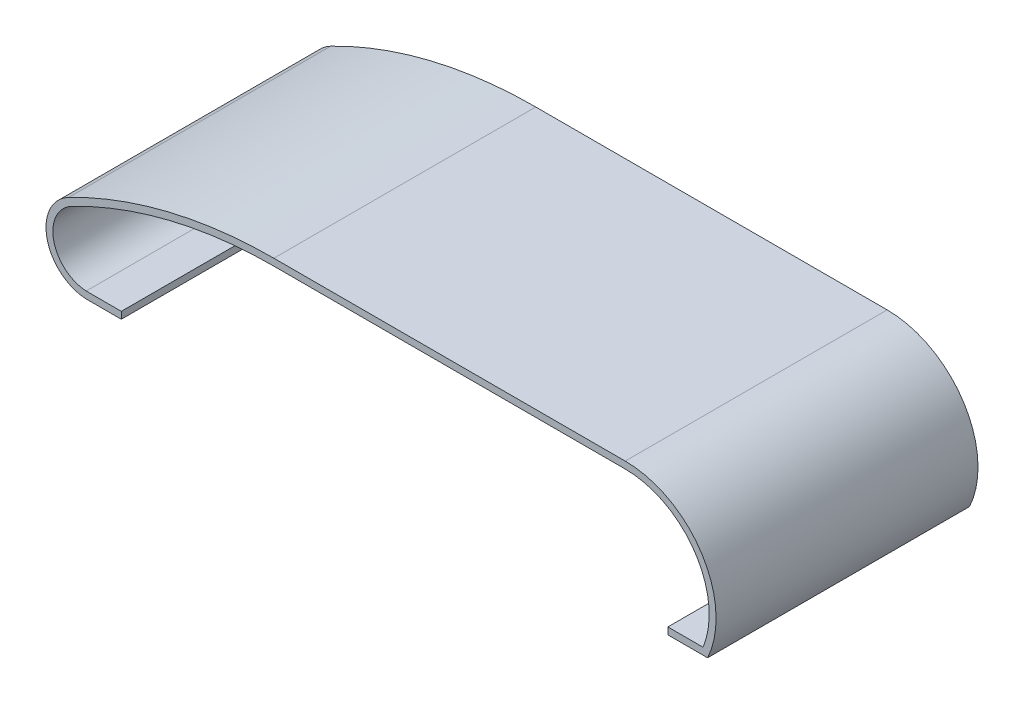
ISO-10303-21;
HEADER;
FILE_DESCRIPTION(('STEP AP214'),'2;1');
FILE_NAME('part.step','',(''),(''),'','','');
FILE_SCHEMA(('AUTOMOTIVE_DESIGN { 1 0 10303 214 1 1 1 1 }'));
ENDSEC;
DATA;
#1=APPLICATION_CONTEXT('core data for automotive mechanical design processes');
#2=APPLICATION_PROTOCOL_DEFINITION('international standard','automotive_design',2000,#1);
#3=PRODUCT_CONTEXT('',#1,'mechanical');
#4=PRODUCT('Part','Part','',(#3));
#5=PRODUCT_RELATED_PRODUCT_CATEGORY('part','',(#4));
#6=PRODUCT_DEFINITION_FORMATION('','',#4);
#7=PRODUCT_DEFINITION_CONTEXT('part definition',#1,'design');
#8=PRODUCT_DEFINITION('design','',#6,#7);
#9=PRODUCT_DEFINITION_SHAPE('','',#8);
#10=(LENGTH_UNIT() NAMED_UNIT(*) SI_UNIT(.MILLI.,.METRE.));
#11=(NAMED_UNIT(*) PLANE_ANGLE_UNIT() SI_UNIT($,.RADIAN.));
#12=(NAMED_UNIT(*) SI_UNIT($,.STERADIAN.) SOLID_ANGLE_UNIT());
#13=UNCERTAINTY_MEASURE_WITH_UNIT(LENGTH_MEASURE(1.E-05),#10,'distance_accuracy_value','');
#14=(GEOMETRIC_REPRESENTATION_CONTEXT(3) GLOBAL_UNCERTAINTY_ASSIGNED_CONTEXT((#13)) GLOBAL_UNIT_ASSIGNED_CONTEXT((#10,
#11,#12)) REPRESENTATION_CONTEXT('',''));
#15=CARTESIAN_POINT('',(0.,0.,0.));
#16=DIRECTION('',(0.,0.,1.));
#17=DIRECTION('',(1.,0.,0.));
#18=AXIS2_PLACEMENT_3D('',#15,#16,#17);
#19=CARTESIAN_POINT('',(0.,14.5,38.));
#20=DIRECTION('',(0.,-1.,0.));
#21=DIRECTION('',(1.,0.,0.));
#22=AXIS2_PLACEMENT_3D('',#19,#20,#21);
#23=PLANE('',#22);
#24=DIRECTION('',(-1.,0.,0.));
#25=VECTOR('',#24,1.);
#26=CARTESIAN_POINT('',(0.,14.5,0.));
#27=LINE('',#26,#25);
#28=CARTESIAN_POINT('',(66.5200000000003,14.5,0.));
#29=VERTEX_POINT('',#28);
#30=CARTESIAN_POINT('',(15.5400000000003,14.5,0.));
#31=VERTEX_POINT('',#30);
#32=EDGE_CURVE('E170',#29,#31,#27,.T.);
#33=ORIENTED_EDGE('',*,*,#32,.T.);
#34=DIRECTION('',(0.,0.,-1.));
#35=VECTOR('',#34,1.);
#36=CARTESIAN_POINT('',(15.5400000000003,14.5,38.));
#37=LINE('',#36,#35);
#38=CARTESIAN_POINT('',(15.5400000000003,14.5,38.));
#39=VERTEX_POINT('',#38);
#40=EDGE_CURVE('E11',#39,#31,#37,.T.);
#41=ORIENTED_EDGE('',*,*,#40,.F.);
#42=DIRECTION('',(-1.,0.,0.));
#43=VECTOR('',#42,1.);
#44=CARTESIAN_POINT('',(0.,14.5,38.));
#45=LINE('',#44,#43);
#46=CARTESIAN_POINT('',(66.5200000000003,14.5,38.));
#47=VERTEX_POINT('',#46);
#48=EDGE_CURVE('E205',#47,#39,#45,.T.);
#49=ORIENTED_EDGE('',*,*,#48,.F.);
#50=DIRECTION('',(0.,0.,-1.));
#51=VECTOR('',#50,1.);
#52=CARTESIAN_POINT('',(66.5200000000003,14.5,38.));
#53=LINE('',#52,#51);
#54=EDGE_CURVE('E53',#47,#29,#53,.T.);
#55=ORIENTED_EDGE('',*,*,#54,.T.);
#56=EDGE_LOOP('',(#33,#41,#49,#55));
#57=FACE_BOUND('',#56,.T.);
#58=ADVANCED_FACE('F37',(#57),#23,.F.);
#59=CARTESIAN_POINT('',(15.5400000000003,-50.2795958789134,38.));
#60=DIRECTION('',(0.,0.,-1.));
#61=DIRECTION('',(-1.,0.,0.));
#62=AXIS2_PLACEMENT_3D('',#59,#60,#61);
#63=CYLINDRICAL_SURFACE('',#62,64.7795958789135);
#64=CARTESIAN_POINT('',(15.5400000000003,-50.2795958789134,0.));
#65=DIRECTION('',(0.,0.,1.));
#66=DIRECTION('',(1.,0.,0.));
#67=AXIS2_PLACEMENT_3D('',#64,#65,#66);
#68=CIRCLE('',#67,64.7795958789135);
#69=CARTESIAN_POINT('',(-14.2250375276555,7.25681505549044,0.));
#70=VERTEX_POINT('',#69);
#71=EDGE_CURVE('E172',#31,#70,#68,.T.);
#72=ORIENTED_EDGE('',*,*,#71,.T.);
#73=DIRECTION('',(0.,0.,-1.));
#74=VECTOR('',#73,1.);
#75=CARTESIAN_POINT('',(-14.2250375276555,7.25681505549044,38.));
#76=LINE('',#75,#74);
#77=CARTESIAN_POINT('',(-14.2250375276555,7.25681505549044,38.));
#78=VERTEX_POINT('',#77);
#79=EDGE_CURVE('E45',#78,#70,#76,.T.);
#80=ORIENTED_EDGE('',*,*,#79,.F.);
#81=CARTESIAN_POINT('',(15.5400000000003,-50.2795958789134,38.));
#82=DIRECTION('',(0.,0.,1.));
#83=DIRECTION('',(1.,0.,0.));
#84=AXIS2_PLACEMENT_3D('',#81,#82,#83);
#85=CIRCLE('',#84,64.7795958789135);
#86=EDGE_CURVE('E109',#39,#78,#85,.T.);
#87=ORIENTED_EDGE('',*,*,#86,.F.);
#88=ORIENTED_EDGE('',*,*,#40,.T.);
#89=EDGE_LOOP('',(#72,#80,#87,#88));
#90=FACE_BOUND('',#89,.T.);
#91=ADVANCED_FACE('F283',(#90),#63,.T.);
#92=CARTESIAN_POINT('',(-11.426599769246,1.84737907905001,38.));
#93=DIRECTION('',(0.,0.,-1.));
#94=DIRECTION('',(-1.,0.,0.));
#95=AXIS2_PLACEMENT_3D('',#92,#93,#94);
#96=CYLINDRICAL_SURFACE('',#95,6.09042293038011);
#97=CARTESIAN_POINT('',(-11.426599769246,1.84737907905001,0.));
#98=DIRECTION('',(0.,0.,1.));
#99=DIRECTION('',(1.,0.,0.));
#100=AXIS2_PLACEMENT_3D('',#97,#98,#99);
#101=CIRCLE('',#100,6.09042293038011);
#102=CARTESIAN_POINT('',(-11.7115140980292,-4.23637595350628,0.));
#103=VERTEX_POINT('',#102);
#104=EDGE_CURVE('E174',#70,#103,#101,.T.);
#105=ORIENTED_EDGE('',*,*,#104,.T.);
#106=DIRECTION('',(0.,0.,-1.));
#107=VECTOR('',#106,1.);
#108=CARTESIAN_POINT('',(-11.7115140980292,-4.23637595350628,38.));
#109=LINE('',#108,#107);
#110=CARTESIAN_POINT('',(-11.7115140980292,-4.23637595350628,38.));
#111=VERTEX_POINT('',#110);
#112=EDGE_CURVE('E224',#111,#103,#109,.T.);
#113=ORIENTED_EDGE('',*,*,#112,.F.);
#114=CARTESIAN_POINT('',(-11.426599769246,1.84737907905001,38.));
#115=DIRECTION('',(0.,0.,1.));
#116=DIRECTION('',(1.,0.,0.));
#117=AXIS2_PLACEMENT_3D('',#114,#115,#116);
#118=CIRCLE('',#117,6.09042293038011);
#119=EDGE_CURVE('E231',#78,#111,#118,.T.);
#120=ORIENTED_EDGE('',*,*,#119,.F.);
#121=ORIENTED_EDGE('',*,*,#79,.T.);
#122=EDGE_LOOP('',(#105,#113,#120,#121));
#123=FACE_BOUND('',#122,.T.);
#124=ADVANCED_FACE('F229',(#123),#96,.T.);
#125=CARTESIAN_POINT('',(-0.000322696639036166,-4.23726784003482,38.));
#126=DIRECTION('',(-7.61567713637186E-05,-0.999999997100073,0.));
#127=DIRECTION('',(0.999999997100073,-7.61567713637186E-05,0.));
#128=AXIS2_PLACEMENT_3D('',#125,#126,#127);
#129=PLANE('',#128);
#130=DIRECTION('',(-0.999999997100073,7.61567713637186E-05,0.));
#131=VECTOR('',#130,1.);
#132=CARTESIAN_POINT('',(-0.000322696639036166,-4.23726784003482,0.));
#133=LINE('',#132,#131);
#134=CARTESIAN_POINT('',(-6.59040304305799,-4.23676596079115,0.));
#135=VERTEX_POINT('',#134);
#136=EDGE_CURVE('E177',#135,#103,#133,.T.);
#137=ORIENTED_EDGE('',*,*,#136,.F.);
#138=DIRECTION('',(0.,0.,-1.));
#139=VECTOR('',#138,1.);
#140=CARTESIAN_POINT('',(-6.59040304305799,-4.23676596079115,38.));
#141=LINE('',#140,#139);
#142=CARTESIAN_POINT('',(-6.59040304305799,-4.23676596079115,38.));
#143=VERTEX_POINT('',#142);
#144=EDGE_CURVE('E222',#143,#135,#141,.T.);
#145=ORIENTED_EDGE('',*,*,#144,.F.);
#146=DIRECTION('',(-0.999999997100073,7.61567713637186E-05,0.));
#147=VECTOR('',#146,1.);
#148=CARTESIAN_POINT('',(-0.000322696639036166,-4.23726784003482,38.));
#149=LINE('',#148,#147);
#150=EDGE_CURVE('E240',#143,#111,#149,.T.);
#151=ORIENTED_EDGE('',*,*,#150,.T.);
#152=ORIENTED_EDGE('',*,*,#112,.T.);
#153=EDGE_LOOP('',(#137,#145,#151,#152));
#154=FACE_BOUND('',#153,.T.);
#155=ADVANCED_FACE('F237',(#154),#129,.T.);
#156=CARTESIAN_POINT('',(-6.59008034641899,0.000501879243616689,38.));
#157=DIRECTION('',(0.999999997100073,-7.61567713562088E-05,0.));
#158=DIRECTION('',(7.61567713562088E-05,0.999999997100073,0.));
#159=AXIS2_PLACEMENT_3D('',#156,#157,#158);
#160=PLANE('',#159);
#161=DIRECTION('',(-7.61567713562088E-05,-0.999999997100073,0.));
#162=VECTOR('',#161,1.);
#163=CARTESIAN_POINT('',(-6.59008034641899,0.000501879243616689,0.));
#164=LINE('',#163,#162);
#165=CARTESIAN_POINT('',(-6.59032688628663,-3.23676596369108,0.));
#166=VERTEX_POINT('',#165);
#167=EDGE_CURVE('E180',#166,#135,#164,.T.);
#168=ORIENTED_EDGE('',*,*,#167,.F.);
#169=DIRECTION('',(0.,0.,-1.));
#170=VECTOR('',#169,1.);
#171=CARTESIAN_POINT('',(-6.59032688628663,-3.23676596369108,38.));
#172=LINE('',#171,#170);
#173=CARTESIAN_POINT('',(-6.59032688628663,-3.23676596369108,38.));
#174=VERTEX_POINT('',#173);
#175=EDGE_CURVE('E220',#174,#166,#172,.T.);
#176=ORIENTED_EDGE('',*,*,#175,.F.);
#177=DIRECTION('',(-7.61567713562088E-05,-0.999999997100073,0.));
#178=VECTOR('',#177,1.);
#179=CARTESIAN_POINT('',(-6.59008034641899,0.000501879243616689,38.));
#180=LINE('',#179,#178);
#181=EDGE_CURVE('E243',#174,#143,#180,.T.);
#182=ORIENTED_EDGE('',*,*,#181,.T.);
#183=ORIENTED_EDGE('',*,*,#144,.T.);
#184=EDGE_LOOP('',(#168,#176,#182,#183));
#185=FACE_BOUND('',#184,.T.);
#186=ADVANCED_FACE('F296',(#185),#160,.T.);
#187=CARTESIAN_POINT('',(-0.000246539867671432,-3.23726784293474,38.));
#188=DIRECTION('',(7.61567713634051E-05,0.999999997100073,0.));
#189=DIRECTION('',(-0.999999997100073,7.61567713634051E-05,0.));
#190=AXIS2_PLACEMENT_3D('',#187,#188,#189);
#191=PLANE('',#190);
#192=DIRECTION('',(0.999999997100073,-7.61567713634051E-05,0.));
#193=VECTOR('',#192,1.);
#194=CARTESIAN_POINT('',(-0.000246539867671432,-3.23726784293474,0.));
#195=LINE('',#194,#193);
#196=CARTESIAN_POINT('',(-11.6870252792904,-3.23637781559573,0.));
#197=VERTEX_POINT('',#196);
#198=EDGE_CURVE('E183',#197,#166,#195,.T.);
#199=ORIENTED_EDGE('',*,*,#198,.F.);
#200=DIRECTION('',(0.,0.,-1.));
#201=VECTOR('',#200,1.);
#202=CARTESIAN_POINT('',(-11.6870252792904,-3.23637781559573,38.));
#203=LINE('',#202,#201);
#204=CARTESIAN_POINT('',(-11.6870252792904,-3.23637781559573,38.));
#205=VERTEX_POINT('',#204);
#206=EDGE_CURVE('E218',#205,#197,#203,.T.);
#207=ORIENTED_EDGE('',*,*,#206,.F.);
#208=DIRECTION('',(0.999999997100073,-7.61567713634051E-05,0.));
#209=VECTOR('',#208,1.);
#210=CARTESIAN_POINT('',(-0.000246539867671432,-3.23726784293474,38.));
#211=LINE('',#210,#209);
#212=EDGE_CURVE('E245',#205,#174,#211,.T.);
#213=ORIENTED_EDGE('',*,*,#212,.T.);
#214=ORIENTED_EDGE('',*,*,#175,.T.);
#215=EDGE_LOOP('',(#199,#207,#213,#214));
#216=FACE_BOUND('',#215,.T.);
#217=ADVANCED_FACE('F299',(#216),#191,.T.);
#218=CARTESIAN_POINT('',(-11.426599769246,1.84737907905001,38.));
#219=DIRECTION('',(0.,0.,-1.));
#220=DIRECTION('',(-1.,0.,0.));
#221=AXIS2_PLACEMENT_3D('',#218,#219,#220);
#222=CYLINDRICAL_SURFACE('',#221,5.09042293038011);
#223=CARTESIAN_POINT('',(-11.426599769246,1.84737907905001,0.));
#224=DIRECTION('',(0.,0.,1.));
#225=DIRECTION('',(1.,0.,0.));
#226=AXIS2_PLACEMENT_3D('',#223,#224,#225);
#227=CIRCLE('',#226,5.09042293038011);
#228=CARTESIAN_POINT('',(-13.7655558479103,6.36862780835242,0.));
#229=VERTEX_POINT('',#228);
#230=EDGE_CURVE('E186',#229,#197,#227,.T.);
#231=ORIENTED_EDGE('',*,*,#230,.F.);
#232=DIRECTION('',(0.,0.,-1.));
#233=VECTOR('',#232,1.);
#234=CARTESIAN_POINT('',(-13.7655558479103,6.36862780835242,38.));
#235=LINE('',#234,#233);
#236=CARTESIAN_POINT('',(-13.7655558479103,6.36862780835242,38.));
#237=VERTEX_POINT('',#236);
#238=EDGE_CURVE('E216',#237,#229,#235,.T.);
#239=ORIENTED_EDGE('',*,*,#238,.F.);
#240=CARTESIAN_POINT('',(-11.426599769246,1.84737907905001,38.));
#241=DIRECTION('',(0.,0.,1.));
#242=DIRECTION('',(1.,0.,0.));
#243=AXIS2_PLACEMENT_3D('',#240,#241,#242);
#244=CIRCLE('',#243,5.09042293038011);
#245=EDGE_CURVE('E252',#237,#205,#244,.T.);
#246=ORIENTED_EDGE('',*,*,#245,.T.);
#247=ORIENTED_EDGE('',*,*,#206,.T.);
#248=EDGE_LOOP('',(#231,#239,#246,#247));
#249=FACE_BOUND('',#248,.T.);
#250=ADVANCED_FACE('F303',(#249),#222,.F.);
#251=CARTESIAN_POINT('',(15.5400000000003,-50.2795958789134,38.));
#252=DIRECTION('',(0.,0.,-1.));
#253=DIRECTION('',(-1.,0.,0.));
#254=AXIS2_PLACEMENT_3D('',#251,#252,#253);
#255=CYLINDRICAL_SURFACE('',#254,63.7795958789135);
#256=CARTESIAN_POINT('',(15.5400000000003,-50.2795958789134,0.));
#257=DIRECTION('',(0.,0.,1.));
#258=DIRECTION('',(1.,0.,0.));
#259=AXIS2_PLACEMENT_3D('',#256,#257,#258);
#260=CIRCLE('',#259,63.7795958789135);
#261=CARTESIAN_POINT('',(15.5400000000003,13.5,0.));
#262=VERTEX_POINT('',#261);
#263=EDGE_CURVE('E189',#262,#229,#260,.T.);
#264=ORIENTED_EDGE('',*,*,#263,.F.);
#265=DIRECTION('',(0.,0.,-1.));
#266=VECTOR('',#265,1.);
#267=CARTESIAN_POINT('',(15.5400000000003,13.5,38.));
#268=LINE('',#267,#266);
#269=CARTESIAN_POINT('',(15.5400000000003,13.5,38.));
#270=VERTEX_POINT('',#269);
#271=EDGE_CURVE('E214',#270,#262,#268,.T.);
#272=ORIENTED_EDGE('',*,*,#271,.F.);
#273=CARTESIAN_POINT('',(15.5400000000003,-50.2795958789134,38.));
#274=DIRECTION('',(0.,0.,1.));
#275=DIRECTION('',(1.,0.,0.));
#276=AXIS2_PLACEMENT_3D('',#273,#274,#275);
#277=CIRCLE('',#276,63.7795958789135);
#278=EDGE_CURVE('E255',#270,#237,#277,.T.);
#279=ORIENTED_EDGE('',*,*,#278,.T.);
#280=ORIENTED_EDGE('',*,*,#238,.T.);
#281=EDGE_LOOP('',(#264,#272,#279,#280));
#282=FACE_BOUND('',#281,.T.);
#283=ADVANCED_FACE('F307',(#282),#255,.F.);
#284=CARTESIAN_POINT('',(0.,13.5,38.));
#285=DIRECTION('',(0.,-1.,0.));
#286=DIRECTION('',(0.,0.,-1.));
#287=AXIS2_PLACEMENT_3D('',#284,#285,#286);
#288=PLANE('',#287);
#289=DIRECTION('',(-1.,0.,0.));
#290=VECTOR('',#289,1.);
#291=CARTESIAN_POINT('',(0.,13.5,0.));
#292=LINE('',#291,#290);
#293=CARTESIAN_POINT('',(66.5200000000003,13.5,0.));
#294=VERTEX_POINT('',#293);
#295=EDGE_CURVE('E192',#294,#262,#292,.T.);
#296=ORIENTED_EDGE('',*,*,#295,.F.);
#297=DIRECTION('',(0.,0.,-1.));
#298=VECTOR('',#297,1.);
#299=CARTESIAN_POINT('',(66.5200000000003,13.5,38.));
#300=LINE('',#299,#298);
#301=CARTESIAN_POINT('',(66.5200000000003,13.5,38.));
#302=VERTEX_POINT('',#301);
#303=EDGE_CURVE('E212',#302,#294,#300,.T.);
#304=ORIENTED_EDGE('',*,*,#303,.F.);
#305=DIRECTION('',(-1.,0.,0.));
#306=VECTOR('',#305,1.);
#307=CARTESIAN_POINT('',(0.,13.5,38.));
#308=LINE('',#307,#306);
#309=EDGE_CURVE('E258',#302,#270,#308,.T.);
#310=ORIENTED_EDGE('',*,*,#309,.T.);
#311=ORIENTED_EDGE('',*,*,#271,.T.);
#312=EDGE_LOOP('',(#296,#304,#310,#311));
#313=FACE_BOUND('',#312,.T.);
#314=ADVANCED_FACE('F311',(#313),#288,.T.);
#315=CARTESIAN_POINT('',(66.5200000000003,1.31995191292337,38.));
#316=DIRECTION('',(0.,0.,-1.));
#317=DIRECTION('',(-1.,0.,0.));
#318=AXIS2_PLACEMENT_3D('',#315,#316,#317);
#319=CYLINDRICAL_SURFACE('',#318,12.1800480870767);
#320=CARTESIAN_POINT('',(66.5200000000003,1.31995191292337,0.));
#321=DIRECTION('',(0.,0.,1.));
#322=DIRECTION('',(1.,0.,0.));
#323=AXIS2_PLACEMENT_3D('',#320,#321,#322);
#324=CIRCLE('',#323,12.1800480870767);
#325=CARTESIAN_POINT('',(77.8129744611661,-3.24319384663276,0.));
#326=VERTEX_POINT('',#325);
#327=EDGE_CURVE('E195',#294,#326,#324,.F.);
#328=ORIENTED_EDGE('',*,*,#327,.T.);
#329=DIRECTION('',(0.,0.,-1.));
#330=VECTOR('',#329,1.);
#331=CARTESIAN_POINT('',(77.8129744611661,-3.24319384663276,38.));
#332=LINE('',#331,#330);
#333=CARTESIAN_POINT('',(77.8129744611661,-3.24319384663276,38.));
#334=VERTEX_POINT('',#333);
#335=EDGE_CURVE('E209',#334,#326,#332,.T.);
#336=ORIENTED_EDGE('',*,*,#335,.F.);
#337=CARTESIAN_POINT('',(66.5200000000003,1.31995191292337,38.));
#338=DIRECTION('',(0.,0.,1.));
#339=DIRECTION('',(1.,0.,0.));
#340=AXIS2_PLACEMENT_3D('',#337,#338,#339);
#341=CIRCLE('',#340,12.1800480870767);
#342=EDGE_CURVE('E261',#302,#334,#341,.F.);
#343=ORIENTED_EDGE('',*,*,#342,.F.);
#344=ORIENTED_EDGE('',*,*,#303,.T.);
#345=EDGE_LOOP('',(#328,#336,#343,#344));
#346=FACE_BOUND('',#345,.T.);
#347=ADVANCED_FACE('F267',(#346),#319,.F.);
#348=CARTESIAN_POINT('',(-0.000246539867672124,-3.23726784293473,38.));
#349=DIRECTION('',(-7.6156771363619E-05,-0.999999997100073,0.));
#350=DIRECTION('',(0.999999997100073,-7.6156771363619E-05,0.));
#351=AXIS2_PLACEMENT_3D('',#348,#349,#350);
#352=PLANE('',#351);
#353=DIRECTION('',(-0.999999997100073,7.6156771363619E-05,0.));
#354=VECTOR('',#353,1.);
#355=CARTESIAN_POINT('',(-0.000246539867672124,-3.23726784293473,0.));
#356=LINE('',#355,#354);
#357=CARTESIAN_POINT('',(72.7050558731262,-3.24280484404358,0.));
#358=VERTEX_POINT('',#357);
#359=EDGE_CURVE('E197',#326,#358,#356,.T.);
#360=ORIENTED_EDGE('',*,*,#359,.T.);
#361=DIRECTION('',(0.,0.,-1.));
#362=VECTOR('',#361,1.);
#363=CARTESIAN_POINT('',(72.7050558731262,-3.24280484404358,38.));
#364=LINE('',#363,#362);
#365=CARTESIAN_POINT('',(72.7050558731262,-3.24280484404358,38.));
#366=VERTEX_POINT('',#365);
#367=EDGE_CURVE('E162',#366,#358,#364,.T.);
#368=ORIENTED_EDGE('',*,*,#367,.F.);
#369=DIRECTION('',(-0.999999997100073,7.6156771363619E-05,0.));
#370=VECTOR('',#369,1.);
#371=CARTESIAN_POINT('',(-0.000246539867672124,-3.23726784293473,38.));
#372=LINE('',#371,#370);
#373=EDGE_CURVE('E150',#334,#366,#372,.T.);
#374=ORIENTED_EDGE('',*,*,#373,.F.);
#375=ORIENTED_EDGE('',*,*,#335,.T.);
#376=EDGE_LOOP('',(#360,#368,#374,#375));
#377=FACE_BOUND('',#376,.T.);
#378=ADVANCED_FACE('F271',(#377),#352,.F.);
#379=CARTESIAN_POINT('',(72.7053024129938,-0.00553700110868571,38.));
#380=DIRECTION('',(0.999999997100073,-7.61567713614137E-05,0.));
#381=DIRECTION('',(7.61567713614137E-05,0.999999997100073,0.));
#382=AXIS2_PLACEMENT_3D('',#379,#380,#381);
#383=PLANE('',#382);
#384=DIRECTION('',(-7.61567713614136E-05,-0.999999997100073,0.));
#385=VECTOR('',#384,1.);
#386=CARTESIAN_POINT('',(72.7053024129938,-0.00553700110868571,0.));
#387=LINE('',#386,#385);
#388=CARTESIAN_POINT('',(72.7049797163548,-4.24280484114364,0.));
#389=VERTEX_POINT('',#388);
#390=EDGE_CURVE('E159',#358,#389,#387,.T.);
#391=ORIENTED_EDGE('',*,*,#390,.T.);
#392=DIRECTION('',(0.,0.,-1.));
#393=VECTOR('',#392,1.);
#394=CARTESIAN_POINT('',(72.7049797163548,-4.24280484114364,38.));
#395=LINE('',#394,#393);
#396=CARTESIAN_POINT('',(72.7049797163548,-4.24280484114364,38.));
#397=VERTEX_POINT('',#396);
#398=EDGE_CURVE('E156',#397,#389,#395,.T.);
#399=ORIENTED_EDGE('',*,*,#398,.F.);
#400=DIRECTION('',(-7.61567713614136E-05,-0.999999997100073,0.));
#401=VECTOR('',#400,1.);
#402=CARTESIAN_POINT('',(72.7053024129938,-0.00553700110868571,38.));
#403=LINE('',#402,#401);
#404=EDGE_CURVE('E143',#366,#397,#403,.T.);
#405=ORIENTED_EDGE('',*,*,#404,.F.);
#406=ORIENTED_EDGE('',*,*,#367,.T.);
#407=EDGE_LOOP('',(#391,#399,#405,#406));
#408=FACE_BOUND('',#407,.T.);
#409=ADVANCED_FACE('F157',(#408),#383,.F.);
#410=CARTESIAN_POINT('',(-0.00032269663904217,-4.23726784003469,38.));
#411=DIRECTION('',(-7.61567713651378E-05,-0.999999997100073,0.));
#412=DIRECTION('',(0.999999997100073,-7.61567713651378E-05,0.));
#413=AXIS2_PLACEMENT_3D('',#410,#411,#412);
#414=PLANE('',#413);
#415=DIRECTION('',(-0.999999997100073,7.61567713651378E-05,0.));
#416=VECTOR('',#415,1.);
#417=CARTESIAN_POINT('',(-0.00032269663904217,-4.23726784003469,0.));
#418=LINE('',#417,#416);
#419=CARTESIAN_POINT('',(78.4684108324822,-4.24324376545071,0.));
#420=VERTEX_POINT('',#419);
#421=EDGE_CURVE('E200',#420,#389,#418,.T.);
#422=ORIENTED_EDGE('',*,*,#421,.F.);
#423=DIRECTION('',(0.,0.,-1.));
#424=VECTOR('',#423,1.);
#425=CARTESIAN_POINT('',(78.4684108324822,-4.24324376545071,38.));
#426=LINE('',#425,#424);
#427=CARTESIAN_POINT('',(78.4684108324822,-4.24324376545071,38.));
#428=VERTEX_POINT('',#427);
#429=EDGE_CURVE('E97',#428,#420,#426,.T.);
#430=ORIENTED_EDGE('',*,*,#429,.F.);
#431=DIRECTION('',(-0.999999997100073,7.61567713651378E-05,0.));
#432=VECTOR('',#431,1.);
#433=CARTESIAN_POINT('',(-0.00032269663904217,-4.23726784003469,38.));
#434=LINE('',#433,#432);
#435=EDGE_CURVE('E148',#428,#397,#434,.T.);
#436=ORIENTED_EDGE('',*,*,#435,.T.);
#437=ORIENTED_EDGE('',*,*,#398,.T.);
#438=EDGE_LOOP('',(#422,#430,#436,#437));
#439=FACE_BOUND('',#438,.T.);
#440=ADVANCED_FACE('F164',(#439),#414,.T.);
#441=CARTESIAN_POINT('',(66.5200000000003,1.31995191292337,38.));
#442=DIRECTION('',(0.,0.,-1.));
#443=DIRECTION('',(-1.,0.,0.));
#444=AXIS2_PLACEMENT_3D('',#441,#442,#443);
#445=CYLINDRICAL_SURFACE('',#444,13.1800480870766);
#446=CARTESIAN_POINT('',(66.5200000000003,1.31995191292337,0.));
#447=DIRECTION('',(0.,0.,1.));
#448=DIRECTION('',(1.,0.,0.));
#449=AXIS2_PLACEMENT_3D('',#446,#447,#448);
#450=CIRCLE('',#449,13.1800480870766);
#451=EDGE_CURVE('E202',#29,#420,#450,.F.);
#452=ORIENTED_EDGE('',*,*,#451,.F.);
#453=ORIENTED_EDGE('',*,*,#54,.F.);
#454=CARTESIAN_POINT('',(66.5200000000003,1.31995191292337,38.));
#455=DIRECTION('',(0.,0.,1.));
#456=DIRECTION('',(1.,0.,0.));
#457=AXIS2_PLACEMENT_3D('',#454,#455,#456);
#458=CIRCLE('',#457,13.1800480870766);
#459=EDGE_CURVE('E165',#47,#428,#458,.F.);
#460=ORIENTED_EDGE('',*,*,#459,.T.);
#461=ORIENTED_EDGE('',*,*,#429,.T.);
#462=EDGE_LOOP('',(#452,#453,#460,#461));
#463=FACE_BOUND('',#462,.T.);
#464=ADVANCED_FACE('F272',(#463),#445,.T.);
#465=CARTESIAN_POINT('',(0.,0.,38.));
#466=DIRECTION('',(0.,0.,1.));
#467=DIRECTION('',(1.,0.,0.));
#468=AXIS2_PLACEMENT_3D('',#465,#466,#467);
#469=PLANE('',#468);
#470=ORIENTED_EDGE('',*,*,#48,.T.);
#471=ORIENTED_EDGE('',*,*,#86,.T.);
#472=ORIENTED_EDGE('',*,*,#119,.T.);
#473=ORIENTED_EDGE('',*,*,#150,.F.);
#474=ORIENTED_EDGE('',*,*,#181,.F.);
#475=ORIENTED_EDGE('',*,*,#212,.F.);
#476=ORIENTED_EDGE('',*,*,#245,.F.);
#477=ORIENTED_EDGE('',*,*,#278,.F.);
#478=ORIENTED_EDGE('',*,*,#309,.F.);
#479=ORIENTED_EDGE('',*,*,#342,.T.);
#480=ORIENTED_EDGE('',*,*,#373,.T.);
#481=ORIENTED_EDGE('',*,*,#404,.T.);
#482=ORIENTED_EDGE('',*,*,#435,.F.);
#483=ORIENTED_EDGE('',*,*,#459,.F.);
#484=EDGE_LOOP('',(#470,#471,#472,#473,#474,#475,#476,#477,#478,#479,#480,#481,#482,#483));
#485=FACE_BOUND('',#484,.T.);
#486=ADVANCED_FACE('F145',(#485),#469,.T.);
#487=CARTESIAN_POINT('',(0.,0.,0.));
#488=DIRECTION('',(0.,0.,1.));
#489=DIRECTION('',(1.,0.,0.));
#490=AXIS2_PLACEMENT_3D('',#487,#488,#489);
#491=PLANE('',#490);
#492=ORIENTED_EDGE('',*,*,#32,.F.);
#493=ORIENTED_EDGE('',*,*,#451,.T.);
#494=ORIENTED_EDGE('',*,*,#421,.T.);
#495=ORIENTED_EDGE('',*,*,#390,.F.);
#496=ORIENTED_EDGE('',*,*,#359,.F.);
#497=ORIENTED_EDGE('',*,*,#327,.F.);
#498=ORIENTED_EDGE('',*,*,#295,.T.);
#499=ORIENTED_EDGE('',*,*,#263,.T.);
#500=ORIENTED_EDGE('',*,*,#230,.T.);
#501=ORIENTED_EDGE('',*,*,#198,.T.);
#502=ORIENTED_EDGE('',*,*,#167,.T.);
#503=ORIENTED_EDGE('',*,*,#136,.T.);
#504=ORIENTED_EDGE('',*,*,#104,.F.);
#505=ORIENTED_EDGE('',*,*,#71,.F.);
#506=EDGE_LOOP('',(#492,#493,#494,#495,#496,#497,#498,#499,#500,#501,#502,#503,#504,#505));
#507=FACE_BOUND('',#506,.T.);
#508=ADVANCED_FACE('F233',(#507),#491,.F.);
#509=CLOSED_SHELL('',(#58,#91,#124,#155,#186,#217,#250,#283,#314,#347,#378,#409,#440,#464,#486,#508));
#510=MANIFOLD_SOLID_BREP('B2',#509);
#511=ADVANCED_BREP_SHAPE_REPRESENTATION('',(#18,#510),#14);
#512=SHAPE_DEFINITION_REPRESENTATION(#9,#511);
ENDSEC;
END-ISO-10303-21;
